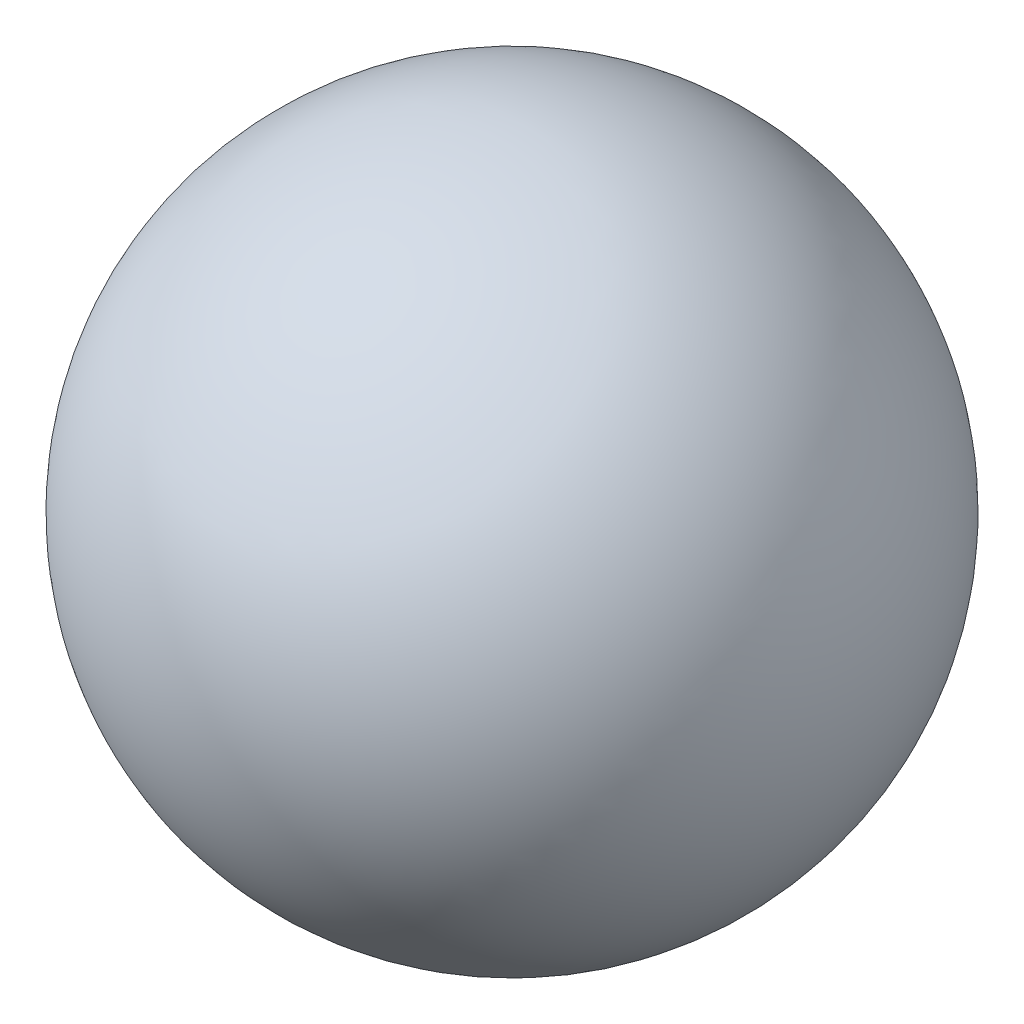
ISO-10303-21;
HEADER;
FILE_DESCRIPTION(('STEP AP214'),'2;1');
FILE_NAME('part.step','',(''),(''),'','','');
FILE_SCHEMA(('AUTOMOTIVE_DESIGN { 1 0 10303 214 1 1 1 1 }'));
ENDSEC;
DATA;
#1=APPLICATION_CONTEXT('core data for automotive mechanical design processes');
#2=APPLICATION_PROTOCOL_DEFINITION('international standard','automotive_design',2000,#1);
#3=PRODUCT_CONTEXT('',#1,'mechanical');
#4=PRODUCT('Part','Part','',(#3));
#5=PRODUCT_RELATED_PRODUCT_CATEGORY('part','',(#4));
#6=PRODUCT_DEFINITION_FORMATION('','',#4);
#7=PRODUCT_DEFINITION_CONTEXT('part definition',#1,'design');
#8=PRODUCT_DEFINITION('design','',#6,#7);
#9=PRODUCT_DEFINITION_SHAPE('','',#8);
#10=(LENGTH_UNIT() NAMED_UNIT(*) SI_UNIT(.MILLI.,.METRE.));
#11=(NAMED_UNIT(*) PLANE_ANGLE_UNIT() SI_UNIT($,.RADIAN.));
#12=(NAMED_UNIT(*) SI_UNIT($,.STERADIAN.) SOLID_ANGLE_UNIT());
#13=UNCERTAINTY_MEASURE_WITH_UNIT(LENGTH_MEASURE(1.E-05),#10,'distance_accuracy_value','');
#14=(GEOMETRIC_REPRESENTATION_CONTEXT(3) GLOBAL_UNCERTAINTY_ASSIGNED_CONTEXT((#13)) GLOBAL_UNIT_ASSIGNED_CONTEXT((#10,
#11,#12)) REPRESENTATION_CONTEXT('',''));
#15=CARTESIAN_POINT('',(0.,0.,0.));
#16=DIRECTION('',(0.,0.,1.));
#17=DIRECTION('',(1.,0.,0.));
#18=AXIS2_PLACEMENT_3D('',#15,#16,#17);
#19=CARTESIAN_POINT('',(7.27705596283615,-3.,3.32332010401508));
#20=DIRECTION('',(0.,0.,1.));
#21=DIRECTION('',(1.,0.,0.));
#22=AXIS2_PLACEMENT_3D('',#19,#20,#21);
#23=SPHERICAL_SURFACE('',#22,1.8);
#24=CARTESIAN_POINT('',(7.27705596283615,-3.,5.12332010401508));
#25=VERTEX_POINT('',#24);
#26=VERTEX_LOOP('',#25);
#27=FACE_BOUND('',#26,.T.);
#28=ADVANCED_FACE('F12',(#27),#23,.T.);
#29=CLOSED_SHELL('',(#28));
#30=MANIFOLD_SOLID_BREP('B1',#29);
#31=ADVANCED_BREP_SHAPE_REPRESENTATION('',(#18,#30),#14);
#32=SHAPE_DEFINITION_REPRESENTATION(#9,#31);
ENDSEC;
END-ISO-10303-21;
